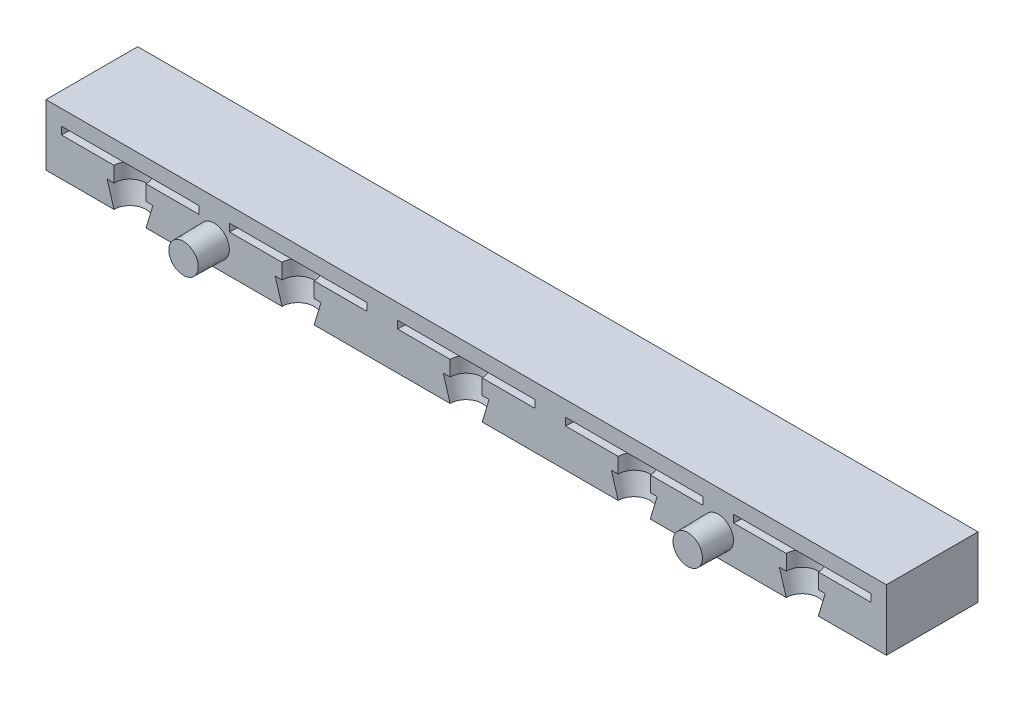
ISO-10303-21;
HEADER;
FILE_DESCRIPTION(('STEP AP214'),'2;1');
FILE_NAME('part.step','',(''),(''),'','','');
FILE_SCHEMA(('AUTOMOTIVE_DESIGN { 1 0 10303 214 1 1 1 1 }'));
ENDSEC;
DATA;
#1=APPLICATION_CONTEXT('core data for automotive mechanical design processes');
#2=APPLICATION_PROTOCOL_DEFINITION('international standard','automotive_design',2000,#1);
#3=PRODUCT_CONTEXT('',#1,'mechanical');
#4=PRODUCT('Part','Part','',(#3));
#5=PRODUCT_RELATED_PRODUCT_CATEGORY('part','',(#4));
#6=PRODUCT_DEFINITION_FORMATION('','',#4);
#7=PRODUCT_DEFINITION_CONTEXT('part definition',#1,'design');
#8=PRODUCT_DEFINITION('design','',#6,#7);
#9=PRODUCT_DEFINITION_SHAPE('','',#8);
#10=(LENGTH_UNIT() NAMED_UNIT(*) SI_UNIT(.MILLI.,.METRE.));
#11=(NAMED_UNIT(*) PLANE_ANGLE_UNIT() SI_UNIT($,.RADIAN.));
#12=(NAMED_UNIT(*) SI_UNIT($,.STERADIAN.) SOLID_ANGLE_UNIT());
#13=UNCERTAINTY_MEASURE_WITH_UNIT(LENGTH_MEASURE(1.E-05),#10,'distance_accuracy_value','');
#14=(GEOMETRIC_REPRESENTATION_CONTEXT(3) GLOBAL_UNCERTAINTY_ASSIGNED_CONTEXT((#13)) GLOBAL_UNIT_ASSIGNED_CONTEXT((#10,
#11,#12)) REPRESENTATION_CONTEXT('',''));
#15=CARTESIAN_POINT('',(0.,0.,0.));
#16=DIRECTION('',(0.,0.,1.));
#17=DIRECTION('',(1.,0.,0.));
#18=AXIS2_PLACEMENT_3D('',#15,#16,#17);
#19=CARTESIAN_POINT('',(0.,0.,-12.));
#20=DIRECTION('',(-1.,0.,0.));
#21=DIRECTION('',(0.,0.,1.));
#22=AXIS2_PLACEMENT_3D('',#19,#20,#21);
#23=PLANE('',#22);
#24=DIRECTION('',(0.,-1.,0.));
#25=VECTOR('',#24,1.);
#26=CARTESIAN_POINT('',(0.,0.,0.));
#27=LINE('',#26,#25);
#28=CARTESIAN_POINT('',(0.,8.,0.));
#29=VERTEX_POINT('',#28);
#30=CARTESIAN_POINT('',(0.,0.,0.));
#31=VERTEX_POINT('',#30);
#32=EDGE_CURVE('E323',#29,#31,#27,.T.);
#33=ORIENTED_EDGE('',*,*,#32,.F.);
#34=DIRECTION('',(0.,0.,1.));
#35=VECTOR('',#34,1.);
#36=CARTESIAN_POINT('',(0.,8.,-12.));
#37=LINE('',#36,#35);
#38=CARTESIAN_POINT('',(0.,8.,-12.));
#39=VERTEX_POINT('',#38);
#40=EDGE_CURVE('E326',#39,#29,#37,.T.);
#41=ORIENTED_EDGE('',*,*,#40,.F.);
#42=DIRECTION('',(0.,-1.,0.));
#43=VECTOR('',#42,1.);
#44=CARTESIAN_POINT('',(0.,0.,-12.));
#45=LINE('',#44,#43);
#46=CARTESIAN_POINT('',(0.,0.,-12.));
#47=VERTEX_POINT('',#46);
#48=EDGE_CURVE('E339',#39,#47,#45,.T.);
#49=ORIENTED_EDGE('',*,*,#48,.T.);
#50=DIRECTION('',(0.,0.,1.));
#51=VECTOR('',#50,1.);
#52=CARTESIAN_POINT('',(0.,0.,-12.));
#53=LINE('',#52,#51);
#54=EDGE_CURVE('E328',#47,#31,#53,.T.);
#55=ORIENTED_EDGE('',*,*,#54,.T.);
#56=EDGE_LOOP('',(#33,#41,#49,#55));
#57=FACE_BOUND('',#56,.T.);
#58=ADVANCED_FACE('F33',(#57),#23,.T.);
#59=CARTESIAN_POINT('',(0.,8.,-12.));
#60=DIRECTION('',(0.,1.,0.));
#61=DIRECTION('',(0.,0.,1.));
#62=AXIS2_PLACEMENT_3D('',#59,#60,#61);
#63=PLANE('',#62);
#64=DIRECTION('',(-1.,0.,0.));
#65=VECTOR('',#64,1.);
#66=CARTESIAN_POINT('',(0.,8.,0.));
#67=LINE('',#66,#65);
#68=CARTESIAN_POINT('',(110.,8.,0.));
#69=VERTEX_POINT('',#68);
#70=EDGE_CURVE('E336',#69,#29,#67,.T.);
#71=ORIENTED_EDGE('',*,*,#70,.F.);
#72=DIRECTION('',(0.,0.,1.));
#73=VECTOR('',#72,1.);
#74=CARTESIAN_POINT('',(110.,8.,-12.));
#75=LINE('',#74,#73);
#76=CARTESIAN_POINT('',(110.,8.,-12.));
#77=VERTEX_POINT('',#76);
#78=EDGE_CURVE('E349',#77,#69,#75,.T.);
#79=ORIENTED_EDGE('',*,*,#78,.F.);
#80=DIRECTION('',(-1.,0.,0.));
#81=VECTOR('',#80,1.);
#82=CARTESIAN_POINT('',(0.,8.,-12.));
#83=LINE('',#82,#81);
#84=EDGE_CURVE('E355',#77,#39,#83,.T.);
#85=ORIENTED_EDGE('',*,*,#84,.T.);
#86=ORIENTED_EDGE('',*,*,#40,.T.);
#87=EDGE_LOOP('',(#71,#79,#85,#86));
#88=FACE_BOUND('',#87,.T.);
#89=ADVANCED_FACE('F314',(#88),#63,.T.);
#90=CARTESIAN_POINT('',(110.,0.,-12.));
#91=DIRECTION('',(1.,0.,0.));
#92=DIRECTION('',(0.,0.,-1.));
#93=AXIS2_PLACEMENT_3D('',#90,#91,#92);
#94=PLANE('',#93);
#95=DIRECTION('',(0.,1.,0.));
#96=VECTOR('',#95,1.);
#97=CARTESIAN_POINT('',(110.,0.,0.));
#98=LINE('',#97,#96);
#99=CARTESIAN_POINT('',(110.,0.,0.));
#100=VERTEX_POINT('',#99);
#101=EDGE_CURVE('E338',#100,#69,#98,.T.);
#102=ORIENTED_EDGE('',*,*,#101,.F.);
#103=DIRECTION('',(0.,0.,1.));
#104=VECTOR('',#103,1.);
#105=CARTESIAN_POINT('',(110.,0.,-12.));
#106=LINE('',#105,#104);
#107=CARTESIAN_POINT('',(110.,0.,-12.));
#108=VERTEX_POINT('',#107);
#109=EDGE_CURVE('E351',#108,#100,#106,.T.);
#110=ORIENTED_EDGE('',*,*,#109,.F.);
#111=DIRECTION('',(0.,1.,0.));
#112=VECTOR('',#111,1.);
#113=CARTESIAN_POINT('',(110.,0.,-12.));
#114=LINE('',#113,#112);
#115=EDGE_CURVE('E544',#108,#77,#114,.T.);
#116=ORIENTED_EDGE('',*,*,#115,.T.);
#117=ORIENTED_EDGE('',*,*,#78,.T.);
#118=EDGE_LOOP('',(#102,#110,#116,#117));
#119=FACE_BOUND('',#118,.T.);
#120=ADVANCED_FACE('F319',(#119),#94,.T.);
#121=CARTESIAN_POINT('',(0.,0.,-12.));
#122=DIRECTION('',(0.,-1.,0.));
#123=DIRECTION('',(0.,0.,-1.));
#124=AXIS2_PLACEMENT_3D('',#121,#122,#123);
#125=PLANE('',#124);
#126=CARTESIAN_POINT('',(99.,0.,0.));
#127=DIRECTION('',(0.,1.,0.));
#128=DIRECTION('',(-1.,0.,0.));
#129=AXIS2_PLACEMENT_3D('',#126,#127,#128);
#130=CIRCLE('',#129,2.1);
#131=CARTESIAN_POINT('',(101.1,0.,0.));
#132=VERTEX_POINT('',#131);
#133=CARTESIAN_POINT('',(96.9,0.,0.));
#134=VERTEX_POINT('',#133);
#135=EDGE_CURVE('E654',#132,#134,#130,.T.);
#136=ORIENTED_EDGE('',*,*,#135,.T.);
#137=DIRECTION('',(1.,0.,0.));
#138=VECTOR('',#137,1.);
#139=CARTESIAN_POINT('',(0.,0.,0.));
#140=LINE('',#139,#138);
#141=CARTESIAN_POINT('',(79.1,0.,0.));
#142=VERTEX_POINT('',#141);
#143=EDGE_CURVE('E484',#142,#134,#140,.T.);
#144=ORIENTED_EDGE('',*,*,#143,.F.);
#145=CARTESIAN_POINT('',(77.,0.,0.));
#146=DIRECTION('',(0.,1.,0.));
#147=DIRECTION('',(-1.,0.,0.));
#148=AXIS2_PLACEMENT_3D('',#145,#146,#147);
#149=CIRCLE('',#148,2.1);
#150=CARTESIAN_POINT('',(74.9,0.,0.));
#151=VERTEX_POINT('',#150);
#152=EDGE_CURVE('E477',#142,#151,#149,.T.);
#153=ORIENTED_EDGE('',*,*,#152,.T.);
#154=CARTESIAN_POINT('',(57.1,0.,0.));
#155=VERTEX_POINT('',#154);
#156=EDGE_CURVE('E472',#155,#151,#140,.T.);
#157=ORIENTED_EDGE('',*,*,#156,.F.);
#158=CARTESIAN_POINT('',(55.,0.,0.));
#159=DIRECTION('',(0.,1.,0.));
#160=DIRECTION('',(-1.,0.,0.));
#161=AXIS2_PLACEMENT_3D('',#158,#159,#160);
#162=CIRCLE('',#161,2.1);
#163=CARTESIAN_POINT('',(52.9,0.,0.));
#164=VERTEX_POINT('',#163);
#165=EDGE_CURVE('E505',#155,#164,#162,.T.);
#166=ORIENTED_EDGE('',*,*,#165,.T.);
#167=CARTESIAN_POINT('',(35.1,0.,0.));
#168=VERTEX_POINT('',#167);
#169=EDGE_CURVE('E550',#168,#164,#140,.T.);
#170=ORIENTED_EDGE('',*,*,#169,.F.);
#171=CARTESIAN_POINT('',(33.,0.,0.));
#172=DIRECTION('',(0.,1.,0.));
#173=DIRECTION('',(-1.,0.,0.));
#174=AXIS2_PLACEMENT_3D('',#171,#172,#173);
#175=CIRCLE('',#174,2.1);
#176=CARTESIAN_POINT('',(30.9,0.,0.));
#177=VERTEX_POINT('',#176);
#178=EDGE_CURVE('E522',#168,#177,#175,.T.);
#179=ORIENTED_EDGE('',*,*,#178,.T.);
#180=CARTESIAN_POINT('',(13.1,0.,0.));
#181=VERTEX_POINT('',#180);
#182=EDGE_CURVE('E548',#181,#177,#140,.T.);
#183=ORIENTED_EDGE('',*,*,#182,.F.);
#184=CARTESIAN_POINT('',(11.,0.,0.));
#185=DIRECTION('',(0.,1.,0.));
#186=DIRECTION('',(-1.,0.,0.));
#187=AXIS2_PLACEMENT_3D('',#184,#185,#186);
#188=CIRCLE('',#187,2.1);
#189=CARTESIAN_POINT('',(8.9,0.,0.));
#190=VERTEX_POINT('',#189);
#191=EDGE_CURVE('E332',#181,#190,#188,.T.);
#192=ORIENTED_EDGE('',*,*,#191,.T.);
#193=EDGE_CURVE('E343',#31,#190,#140,.T.);
#194=ORIENTED_EDGE('',*,*,#193,.F.);
#195=ORIENTED_EDGE('',*,*,#54,.F.);
#196=DIRECTION('',(1.,0.,0.));
#197=VECTOR('',#196,1.);
#198=CARTESIAN_POINT('',(0.,0.,-12.));
#199=LINE('',#198,#197);
#200=EDGE_CURVE('E341',#47,#108,#199,.T.);
#201=ORIENTED_EDGE('',*,*,#200,.T.);
#202=ORIENTED_EDGE('',*,*,#109,.T.);
#203=EDGE_CURVE('E331',#132,#100,#140,.T.);
#204=ORIENTED_EDGE('',*,*,#203,.F.);
#205=EDGE_LOOP('',(#136,#144,#153,#157,#166,#170,#179,#183,#192,#194,#195,#201,#202,#204));
#206=FACE_BOUND('',#205,.T.);
#207=ADVANCED_FACE('F308',(#206),#125,.T.);
#208=CARTESIAN_POINT('',(0.,0.,-12.));
#209=DIRECTION('',(0.,0.,-1.));
#210=DIRECTION('',(-1.,0.,0.));
#211=AXIS2_PLACEMENT_3D('',#208,#209,#210);
#212=PLANE('',#211);
#213=ORIENTED_EDGE('',*,*,#48,.F.);
#214=ORIENTED_EDGE('',*,*,#84,.F.);
#215=ORIENTED_EDGE('',*,*,#115,.F.);
#216=ORIENTED_EDGE('',*,*,#200,.F.);
#217=EDGE_LOOP('',(#213,#214,#215,#216));
#218=FACE_BOUND('',#217,.T.);
#219=ADVANCED_FACE('F298',(#218),#212,.T.);
#220=CARTESIAN_POINT('',(0.,0.,0.));
#221=DIRECTION('',(0.,0.,-1.));
#222=DIRECTION('',(-1.,0.,0.));
#223=AXIS2_PLACEMENT_3D('',#220,#221,#222);
#224=PLANE('',#223);
#225=CARTESIAN_POINT('',(88.,3.,0.));
#226=DIRECTION('',(0.,0.,-1.));
#227=DIRECTION('',(-1.,0.,0.));
#228=AXIS2_PLACEMENT_3D('',#225,#226,#227);
#229=CIRCLE('',#228,2.);
#230=CARTESIAN_POINT('',(86.,3.,0.));
#231=VERTEX_POINT('',#230);
#232=EDGE_CURVE('E11',#231,#231,#229,.F.);
#233=ORIENTED_EDGE('',*,*,#232,.F.);
#234=EDGE_LOOP('',(#233));
#235=FACE_BOUND('',#234,.T.);
#236=CARTESIAN_POINT('',(22.,3.,0.));
#237=DIRECTION('',(0.,0.,-1.));
#238=DIRECTION('',(-1.,0.,0.));
#239=AXIS2_PLACEMENT_3D('',#236,#237,#238);
#240=CIRCLE('',#239,2.);
#241=CARTESIAN_POINT('',(20.,3.,0.));
#242=VERTEX_POINT('',#241);
#243=EDGE_CURVE('E40',#242,#242,#240,.F.);
#244=ORIENTED_EDGE('',*,*,#243,.F.);
#245=EDGE_LOOP('',(#244));
#246=FACE_BOUND('',#245,.T.);
#247=ORIENTED_EDGE('',*,*,#143,.T.);
#248=DIRECTION('',(-0.287347885566346,0.957826285221151,0.));
#249=VECTOR('',#248,1.);
#250=CARTESIAN_POINT('',(99.,-7.,0.));
#251=LINE('',#250,#249);
#252=CARTESIAN_POINT('',(96.,3.,0.));
#253=VERTEX_POINT('',#252);
#254=EDGE_CURVE('E289',#134,#253,#251,.T.);
#255=ORIENTED_EDGE('',*,*,#254,.T.);
#256=DIRECTION('',(1.,0.,0.));
#257=VECTOR('',#256,1.);
#258=CARTESIAN_POINT('',(0.,2.99999999999998,0.));
#259=LINE('',#258,#257);
#260=CARTESIAN_POINT('',(96.9,3.,0.));
#261=VERTEX_POINT('',#260);
#262=EDGE_CURVE('E285',#253,#261,#259,.T.);
#263=ORIENTED_EDGE('',*,*,#262,.T.);
#264=DIRECTION('',(0.,1.,0.));
#265=VECTOR('',#264,1.);
#266=CARTESIAN_POINT('',(96.9,6.,0.));
#267=LINE('',#266,#265);
#268=CARTESIAN_POINT('',(96.9,5.,0.));
#269=VERTEX_POINT('',#268);
#270=EDGE_CURVE('E280',#261,#269,#267,.T.);
#271=ORIENTED_EDGE('',*,*,#270,.T.);
#272=DIRECTION('',(-1.,0.,0.));
#273=VECTOR('',#272,1.);
#274=CARTESIAN_POINT('',(0.,4.99999999999998,0.));
#275=LINE('',#274,#273);
#276=CARTESIAN_POINT('',(90.,5.,0.));
#277=VERTEX_POINT('',#276);
#278=EDGE_CURVE('E271',#269,#277,#275,.T.);
#279=ORIENTED_EDGE('',*,*,#278,.T.);
#280=DIRECTION('',(0.,1.,0.));
#281=VECTOR('',#280,1.);
#282=CARTESIAN_POINT('',(90.,6.,0.));
#283=LINE('',#282,#281);
#284=CARTESIAN_POINT('',(90.,6.,0.));
#285=VERTEX_POINT('',#284);
#286=EDGE_CURVE('E262',#277,#285,#283,.T.);
#287=ORIENTED_EDGE('',*,*,#286,.T.);
#288=DIRECTION('',(1.,0.,0.));
#289=VECTOR('',#288,1.);
#290=CARTESIAN_POINT('',(0.,5.99999999999997,0.));
#291=LINE('',#290,#289);
#292=CARTESIAN_POINT('',(108.,6.,0.));
#293=VERTEX_POINT('',#292);
#294=EDGE_CURVE('E251',#285,#293,#291,.T.);
#295=ORIENTED_EDGE('',*,*,#294,.T.);
#296=DIRECTION('',(0.,1.,0.));
#297=VECTOR('',#296,1.);
#298=CARTESIAN_POINT('',(108.,6.,0.));
#299=LINE('',#298,#297);
#300=CARTESIAN_POINT('',(108.,5.00000000000001,0.));
#301=VERTEX_POINT('',#300);
#302=EDGE_CURVE('E256',#293,#301,#299,.F.);
#303=ORIENTED_EDGE('',*,*,#302,.T.);
#304=CARTESIAN_POINT('',(101.1,5.,0.));
#305=VERTEX_POINT('',#304);
#306=EDGE_CURVE('E273',#301,#305,#275,.T.);
#307=ORIENTED_EDGE('',*,*,#306,.T.);
#308=DIRECTION('',(0.,1.,0.));
#309=VECTOR('',#308,1.);
#310=CARTESIAN_POINT('',(101.1,6.,0.));
#311=LINE('',#310,#309);
#312=CARTESIAN_POINT('',(101.1,3.,0.));
#313=VERTEX_POINT('',#312);
#314=EDGE_CURVE('E277',#305,#313,#311,.F.);
#315=ORIENTED_EDGE('',*,*,#314,.T.);
#316=CARTESIAN_POINT('',(102.,3.,0.));
#317=VERTEX_POINT('',#316);
#318=EDGE_CURVE('E282',#313,#317,#259,.T.);
#319=ORIENTED_EDGE('',*,*,#318,.T.);
#320=DIRECTION('',(-0.287347885566345,-0.957826285221152,0.));
#321=VECTOR('',#320,1.);
#322=CARTESIAN_POINT('',(99.,-7.,0.));
#323=LINE('',#322,#321);
#324=EDGE_CURVE('E286',#317,#132,#323,.T.);
#325=ORIENTED_EDGE('',*,*,#324,.T.);
#326=ORIENTED_EDGE('',*,*,#203,.T.);
#327=ORIENTED_EDGE('',*,*,#101,.T.);
#328=ORIENTED_EDGE('',*,*,#70,.T.);
#329=ORIENTED_EDGE('',*,*,#32,.T.);
#330=ORIENTED_EDGE('',*,*,#193,.T.);
#331=DIRECTION('',(-0.287347885566346,0.957826285221151,0.));
#332=VECTOR('',#331,1.);
#333=CARTESIAN_POINT('',(11.,-7.,0.));
#334=LINE('',#333,#332);
#335=CARTESIAN_POINT('',(8.,3.,0.));
#336=VERTEX_POINT('',#335);
#337=EDGE_CURVE('E381',#190,#336,#334,.T.);
#338=ORIENTED_EDGE('',*,*,#337,.T.);
#339=DIRECTION('',(1.,0.,0.));
#340=VECTOR('',#339,1.);
#341=CARTESIAN_POINT('',(0.,3.,0.));
#342=LINE('',#341,#340);
#343=CARTESIAN_POINT('',(8.9,3.,0.));
#344=VERTEX_POINT('',#343);
#345=EDGE_CURVE('E377',#336,#344,#342,.T.);
#346=ORIENTED_EDGE('',*,*,#345,.T.);
#347=DIRECTION('',(0.,1.,0.));
#348=VECTOR('',#347,1.);
#349=CARTESIAN_POINT('',(8.9,6.,0.));
#350=LINE('',#349,#348);
#351=CARTESIAN_POINT('',(8.9,5.,0.));
#352=VERTEX_POINT('',#351);
#353=EDGE_CURVE('E371',#344,#352,#350,.T.);
#354=ORIENTED_EDGE('',*,*,#353,.T.);
#355=DIRECTION('',(-1.,0.,0.));
#356=VECTOR('',#355,1.);
#357=CARTESIAN_POINT('',(0.,5.,0.));
#358=LINE('',#357,#356);
#359=CARTESIAN_POINT('',(1.99999999999999,5.,0.));
#360=VERTEX_POINT('',#359);
#361=EDGE_CURVE('E364',#352,#360,#358,.T.);
#362=ORIENTED_EDGE('',*,*,#361,.T.);
#363=DIRECTION('',(0.,1.,0.));
#364=VECTOR('',#363,1.);
#365=CARTESIAN_POINT('',(1.99999999999999,6.,0.));
#366=LINE('',#365,#364);
#367=CARTESIAN_POINT('',(1.99999999999999,6.,0.));
#368=VERTEX_POINT('',#367);
#369=EDGE_CURVE('E361',#360,#368,#366,.T.);
#370=ORIENTED_EDGE('',*,*,#369,.T.);
#371=DIRECTION('',(1.,0.,0.));
#372=VECTOR('',#371,1.);
#373=CARTESIAN_POINT('',(0.,6.,0.));
#374=LINE('',#373,#372);
#375=CARTESIAN_POINT('',(20.,6.,0.));
#376=VERTEX_POINT('',#375);
#377=EDGE_CURVE('E348',#368,#376,#374,.T.);
#378=ORIENTED_EDGE('',*,*,#377,.T.);
#379=DIRECTION('',(0.,1.,0.));
#380=VECTOR('',#379,1.);
#381=CARTESIAN_POINT('',(20.,6.,0.));
#382=LINE('',#381,#380);
#383=CARTESIAN_POINT('',(20.,5.,0.));
#384=VERTEX_POINT('',#383);
#385=EDGE_CURVE('E358',#376,#384,#382,.F.);
#386=ORIENTED_EDGE('',*,*,#385,.T.);
#387=CARTESIAN_POINT('',(13.1,5.,0.));
#388=VERTEX_POINT('',#387);
#389=EDGE_CURVE('E367',#384,#388,#358,.T.);
#390=ORIENTED_EDGE('',*,*,#389,.T.);
#391=DIRECTION('',(0.,1.,0.));
#392=VECTOR('',#391,1.);
#393=CARTESIAN_POINT('',(13.1,6.,0.));
#394=LINE('',#393,#392);
#395=CARTESIAN_POINT('',(13.1,3.,0.));
#396=VERTEX_POINT('',#395);
#397=EDGE_CURVE('E368',#388,#396,#394,.F.);
#398=ORIENTED_EDGE('',*,*,#397,.T.);
#399=CARTESIAN_POINT('',(14.,3.,0.));
#400=VERTEX_POINT('',#399);
#401=EDGE_CURVE('E374',#396,#400,#342,.T.);
#402=ORIENTED_EDGE('',*,*,#401,.T.);
#403=DIRECTION('',(-0.287347885566345,-0.957826285221152,0.));
#404=VECTOR('',#403,1.);
#405=CARTESIAN_POINT('',(11.,-7.,0.));
#406=LINE('',#405,#404);
#407=EDGE_CURVE('E378',#400,#181,#406,.T.);
#408=ORIENTED_EDGE('',*,*,#407,.T.);
#409=ORIENTED_EDGE('',*,*,#182,.T.);
#410=DIRECTION('',(-0.287347885566346,0.957826285221151,0.));
#411=VECTOR('',#410,1.);
#412=CARTESIAN_POINT('',(33.,-7.,0.));
#413=LINE('',#412,#411);
#414=CARTESIAN_POINT('',(30.,3.,0.));
#415=VERTEX_POINT('',#414);
#416=EDGE_CURVE('E410',#177,#415,#413,.T.);
#417=ORIENTED_EDGE('',*,*,#416,.T.);
#418=DIRECTION('',(1.,0.,0.));
#419=VECTOR('',#418,1.);
#420=CARTESIAN_POINT('',(0.,2.99999999999999,0.));
#421=LINE('',#420,#419);
#422=CARTESIAN_POINT('',(30.9,3.,0.));
#423=VERTEX_POINT('',#422);
#424=EDGE_CURVE('E406',#415,#423,#421,.T.);
#425=ORIENTED_EDGE('',*,*,#424,.T.);
#426=DIRECTION('',(0.,1.,0.));
#427=VECTOR('',#426,1.);
#428=CARTESIAN_POINT('',(30.9,6.,0.));
#429=LINE('',#428,#427);
#430=CARTESIAN_POINT('',(30.9,5.,0.));
#431=VERTEX_POINT('',#430);
#432=EDGE_CURVE('E400',#423,#431,#429,.T.);
#433=ORIENTED_EDGE('',*,*,#432,.T.);
#434=DIRECTION('',(-1.,0.,0.));
#435=VECTOR('',#434,1.);
#436=CARTESIAN_POINT('',(0.,4.99999999999999,0.));
#437=LINE('',#436,#435);
#438=CARTESIAN_POINT('',(24.,5.,0.));
#439=VERTEX_POINT('',#438);
#440=EDGE_CURVE('E393',#431,#439,#437,.T.);
#441=ORIENTED_EDGE('',*,*,#440,.T.);
#442=DIRECTION('',(0.,1.,0.));
#443=VECTOR('',#442,1.);
#444=CARTESIAN_POINT('',(24.,6.,0.));
#445=LINE('',#444,#443);
#446=CARTESIAN_POINT('',(24.,6.,0.));
#447=VERTEX_POINT('',#446);
#448=EDGE_CURVE('E390',#439,#447,#445,.T.);
#449=ORIENTED_EDGE('',*,*,#448,.T.);
#450=DIRECTION('',(1.,0.,0.));
#451=VECTOR('',#450,1.);
#452=CARTESIAN_POINT('',(0.,5.99999999999999,0.));
#453=LINE('',#452,#451);
#454=CARTESIAN_POINT('',(42.,6.,0.));
#455=VERTEX_POINT('',#454);
#456=EDGE_CURVE('E384',#447,#455,#453,.T.);
#457=ORIENTED_EDGE('',*,*,#456,.T.);
#458=DIRECTION('',(0.,1.,0.));
#459=VECTOR('',#458,1.);
#460=CARTESIAN_POINT('',(42.,6.,0.));
#461=LINE('',#460,#459);
#462=CARTESIAN_POINT('',(42.,5.,0.));
#463=VERTEX_POINT('',#462);
#464=EDGE_CURVE('E387',#455,#463,#461,.F.);
#465=ORIENTED_EDGE('',*,*,#464,.T.);
#466=CARTESIAN_POINT('',(35.1,5.,0.));
#467=VERTEX_POINT('',#466);
#468=EDGE_CURVE('E396',#463,#467,#437,.T.);
#469=ORIENTED_EDGE('',*,*,#468,.T.);
#470=DIRECTION('',(0.,1.,0.));
#471=VECTOR('',#470,1.);
#472=CARTESIAN_POINT('',(35.1,6.,0.));
#473=LINE('',#472,#471);
#474=CARTESIAN_POINT('',(35.1,3.,0.));
#475=VERTEX_POINT('',#474);
#476=EDGE_CURVE('E397',#467,#475,#473,.F.);
#477=ORIENTED_EDGE('',*,*,#476,.T.);
#478=CARTESIAN_POINT('',(36.,3.,0.));
#479=VERTEX_POINT('',#478);
#480=EDGE_CURVE('E403',#475,#479,#421,.T.);
#481=ORIENTED_EDGE('',*,*,#480,.T.);
#482=DIRECTION('',(-0.287347885566345,-0.957826285221152,0.));
#483=VECTOR('',#482,1.);
#484=CARTESIAN_POINT('',(33.,-7.,0.));
#485=LINE('',#484,#483);
#486=EDGE_CURVE('E407',#479,#168,#485,.T.);
#487=ORIENTED_EDGE('',*,*,#486,.T.);
#488=ORIENTED_EDGE('',*,*,#169,.T.);
#489=DIRECTION('',(-0.287347885566346,0.957826285221151,0.));
#490=VECTOR('',#489,1.);
#491=CARTESIAN_POINT('',(55.,-7.,0.));
#492=LINE('',#491,#490);
#493=CARTESIAN_POINT('',(52.,3.,0.));
#494=VERTEX_POINT('',#493);
#495=EDGE_CURVE('E439',#164,#494,#492,.T.);
#496=ORIENTED_EDGE('',*,*,#495,.T.);
#497=DIRECTION('',(1.,0.,0.));
#498=VECTOR('',#497,1.);
#499=CARTESIAN_POINT('',(0.,2.99999999999999,0.));
#500=LINE('',#499,#498);
#501=CARTESIAN_POINT('',(52.9,3.,0.));
#502=VERTEX_POINT('',#501);
#503=EDGE_CURVE('E435',#494,#502,#500,.T.);
#504=ORIENTED_EDGE('',*,*,#503,.T.);
#505=DIRECTION('',(0.,1.,0.));
#506=VECTOR('',#505,1.);
#507=CARTESIAN_POINT('',(52.9,6.,0.));
#508=LINE('',#507,#506);
#509=CARTESIAN_POINT('',(52.9,5.,0.));
#510=VERTEX_POINT('',#509);
#511=EDGE_CURVE('E429',#502,#510,#508,.T.);
#512=ORIENTED_EDGE('',*,*,#511,.T.);
#513=DIRECTION('',(-1.,0.,0.));
#514=VECTOR('',#513,1.);
#515=CARTESIAN_POINT('',(0.,4.99999999999999,0.));
#516=LINE('',#515,#514);
#517=CARTESIAN_POINT('',(46.,5.,0.));
#518=VERTEX_POINT('',#517);
#519=EDGE_CURVE('E422',#510,#518,#516,.T.);
#520=ORIENTED_EDGE('',*,*,#519,.T.);
#521=DIRECTION('',(0.,1.,0.));
#522=VECTOR('',#521,1.);
#523=CARTESIAN_POINT('',(46.,6.,0.));
#524=LINE('',#523,#522);
#525=CARTESIAN_POINT('',(46.,6.,0.));
#526=VERTEX_POINT('',#525);
#527=EDGE_CURVE('E419',#518,#526,#524,.T.);
#528=ORIENTED_EDGE('',*,*,#527,.T.);
#529=DIRECTION('',(1.,0.,0.));
#530=VECTOR('',#529,1.);
#531=CARTESIAN_POINT('',(0.,5.99999999999998,0.));
#532=LINE('',#531,#530);
#533=CARTESIAN_POINT('',(64.,6.,0.));
#534=VERTEX_POINT('',#533);
#535=EDGE_CURVE('E413',#526,#534,#532,.T.);
#536=ORIENTED_EDGE('',*,*,#535,.T.);
#537=DIRECTION('',(0.,1.,0.));
#538=VECTOR('',#537,1.);
#539=CARTESIAN_POINT('',(64.,6.,0.));
#540=LINE('',#539,#538);
#541=CARTESIAN_POINT('',(64.,5.,0.));
#542=VERTEX_POINT('',#541);
#543=EDGE_CURVE('E416',#534,#542,#540,.F.);
#544=ORIENTED_EDGE('',*,*,#543,.T.);
#545=CARTESIAN_POINT('',(57.1,5.,0.));
#546=VERTEX_POINT('',#545);
#547=EDGE_CURVE('E425',#542,#546,#516,.T.);
#548=ORIENTED_EDGE('',*,*,#547,.T.);
#549=DIRECTION('',(0.,1.,0.));
#550=VECTOR('',#549,1.);
#551=CARTESIAN_POINT('',(57.1,6.,0.));
#552=LINE('',#551,#550);
#553=CARTESIAN_POINT('',(57.1,3.,0.));
#554=VERTEX_POINT('',#553);
#555=EDGE_CURVE('E426',#546,#554,#552,.F.);
#556=ORIENTED_EDGE('',*,*,#555,.T.);
#557=CARTESIAN_POINT('',(58.,3.,0.));
#558=VERTEX_POINT('',#557);
#559=EDGE_CURVE('E432',#554,#558,#500,.T.);
#560=ORIENTED_EDGE('',*,*,#559,.T.);
#561=DIRECTION('',(-0.287347885566345,-0.957826285221152,0.));
#562=VECTOR('',#561,1.);
#563=CARTESIAN_POINT('',(55.,-7.,0.));
#564=LINE('',#563,#562);
#565=EDGE_CURVE('E436',#558,#155,#564,.T.);
#566=ORIENTED_EDGE('',*,*,#565,.T.);
#567=ORIENTED_EDGE('',*,*,#156,.T.);
#568=DIRECTION('',(-0.287347885566346,0.957826285221151,0.));
#569=VECTOR('',#568,1.);
#570=CARTESIAN_POINT('',(77.,-7.,0.));
#571=LINE('',#570,#569);
#572=CARTESIAN_POINT('',(74.,3.,0.));
#573=VERTEX_POINT('',#572);
#574=EDGE_CURVE('E257',#151,#573,#571,.T.);
#575=ORIENTED_EDGE('',*,*,#574,.T.);
#576=DIRECTION('',(1.,0.,0.));
#577=VECTOR('',#576,1.);
#578=CARTESIAN_POINT('',(0.,2.99999999999998,0.));
#579=LINE('',#578,#577);
#580=CARTESIAN_POINT('',(74.9,3.,0.));
#581=VERTEX_POINT('',#580);
#582=EDGE_CURVE('E464',#573,#581,#579,.T.);
#583=ORIENTED_EDGE('',*,*,#582,.T.);
#584=DIRECTION('',(0.,1.,0.));
#585=VECTOR('',#584,1.);
#586=CARTESIAN_POINT('',(74.9,6.,0.));
#587=LINE('',#586,#585);
#588=CARTESIAN_POINT('',(74.9,5.,0.));
#589=VERTEX_POINT('',#588);
#590=EDGE_CURVE('E458',#581,#589,#587,.T.);
#591=ORIENTED_EDGE('',*,*,#590,.T.);
#592=DIRECTION('',(-1.,0.,0.));
#593=VECTOR('',#592,1.);
#594=CARTESIAN_POINT('',(0.,4.99999999999998,0.));
#595=LINE('',#594,#593);
#596=CARTESIAN_POINT('',(68.,5.,0.));
#597=VERTEX_POINT('',#596);
#598=EDGE_CURVE('E451',#589,#597,#595,.T.);
#599=ORIENTED_EDGE('',*,*,#598,.T.);
#600=DIRECTION('',(0.,1.,0.));
#601=VECTOR('',#600,1.);
#602=CARTESIAN_POINT('',(68.,6.,0.));
#603=LINE('',#602,#601);
#604=CARTESIAN_POINT('',(68.,6.,0.));
#605=VERTEX_POINT('',#604);
#606=EDGE_CURVE('E448',#597,#605,#603,.T.);
#607=ORIENTED_EDGE('',*,*,#606,.T.);
#608=DIRECTION('',(1.,0.,0.));
#609=VECTOR('',#608,1.);
#610=CARTESIAN_POINT('',(0.,5.99999999999998,0.));
#611=LINE('',#610,#609);
#612=CARTESIAN_POINT('',(86.,6.,0.));
#613=VERTEX_POINT('',#612);
#614=EDGE_CURVE('E442',#605,#613,#611,.T.);
#615=ORIENTED_EDGE('',*,*,#614,.T.);
#616=DIRECTION('',(0.,1.,0.));
#617=VECTOR('',#616,1.);
#618=CARTESIAN_POINT('',(86.,6.,0.));
#619=LINE('',#618,#617);
#620=CARTESIAN_POINT('',(86.,5.,0.));
#621=VERTEX_POINT('',#620);
#622=EDGE_CURVE('E445',#613,#621,#619,.F.);
#623=ORIENTED_EDGE('',*,*,#622,.T.);
#624=CARTESIAN_POINT('',(79.1,5.,0.));
#625=VERTEX_POINT('',#624);
#626=EDGE_CURVE('E454',#621,#625,#595,.T.);
#627=ORIENTED_EDGE('',*,*,#626,.T.);
#628=DIRECTION('',(0.,1.,0.));
#629=VECTOR('',#628,1.);
#630=CARTESIAN_POINT('',(79.1,6.,0.));
#631=LINE('',#630,#629);
#632=CARTESIAN_POINT('',(79.1,3.,0.));
#633=VERTEX_POINT('',#632);
#634=EDGE_CURVE('E455',#625,#633,#631,.F.);
#635=ORIENTED_EDGE('',*,*,#634,.T.);
#636=CARTESIAN_POINT('',(80.,3.,0.));
#637=VERTEX_POINT('',#636);
#638=EDGE_CURVE('E461',#633,#637,#579,.T.);
#639=ORIENTED_EDGE('',*,*,#638,.T.);
#640=DIRECTION('',(-0.287347885566345,-0.957826285221152,0.));
#641=VECTOR('',#640,1.);
#642=CARTESIAN_POINT('',(77.,-7.,0.));
#643=LINE('',#642,#641);
#644=EDGE_CURVE('E465',#637,#142,#643,.T.);
#645=ORIENTED_EDGE('',*,*,#644,.T.);
#646=EDGE_LOOP('',(#247,#255,#263,#271,#279,#287,#295,#303,#307,#315,#319,#325,#326,#327,#328,
#329,#330,#338,#346,#354,#362,#370,#378,#386,#390,#398,#402,#408,#409,#417,#425,#433,#441,#449,
#457,#465,#469,#477,#481,#487,#488,#496,#504,#512,#520,#528,#536,#544,#548,#556,#560,#566,#567,
#575,#583,#591,#599,#607,#615,#623,#627,#635,#639,#645));
#647=FACE_BOUND('',#646,.T.);
#648=ADVANCED_FACE('F269',(#235,#246,#647),#224,.F.);
#649=CARTESIAN_POINT('',(11.,3.,0.));
#650=DIRECTION('',(0.,1.,0.));
#651=DIRECTION('',(-1.,0.,0.));
#652=AXIS2_PLACEMENT_3D('',#649,#650,#651);
#653=CONICAL_SURFACE('',#652,3.,0.291456794477867);
#654=ORIENTED_EDGE('',*,*,#191,.F.);
#655=ORIENTED_EDGE('',*,*,#407,.F.);
#656=CARTESIAN_POINT('',(11.,3.,0.));
#657=DIRECTION('',(0.,1.,0.));
#658=DIRECTION('',(-1.,0.,0.));
#659=AXIS2_PLACEMENT_3D('',#656,#657,#658);
#660=CIRCLE('',#659,3.);
#661=EDGE_CURVE('E537',#400,#336,#660,.T.);
#662=ORIENTED_EDGE('',*,*,#661,.T.);
#663=ORIENTED_EDGE('',*,*,#337,.F.);
#664=EDGE_LOOP('',(#654,#655,#662,#663));
#665=FACE_BOUND('',#664,.T.);
#666=ADVANCED_FACE('F297',(#665),#653,.F.);
#667=CARTESIAN_POINT('',(8.,3.,0.));
#668=DIRECTION('',(0.,1.,0.));
#669=DIRECTION('',(-1.,0.,0.));
#670=AXIS2_PLACEMENT_3D('',#667,#668,#669);
#671=PLANE('',#670);
#672=ORIENTED_EDGE('',*,*,#661,.F.);
#673=ORIENTED_EDGE('',*,*,#401,.F.);
#674=CARTESIAN_POINT('',(11.,3.,0.));
#675=DIRECTION('',(0.,1.,0.));
#676=DIRECTION('',(-1.,0.,0.));
#677=AXIS2_PLACEMENT_3D('',#674,#675,#676);
#678=CIRCLE('',#677,2.1);
#679=EDGE_CURVE('E534',#396,#344,#678,.T.);
#680=ORIENTED_EDGE('',*,*,#679,.T.);
#681=ORIENTED_EDGE('',*,*,#345,.F.);
#682=EDGE_LOOP('',(#672,#673,#680,#681));
#683=FACE_BOUND('',#682,.T.);
#684=ADVANCED_FACE('F305',(#683),#671,.F.);
#685=CARTESIAN_POINT('',(11.,6.,0.));
#686=DIRECTION('',(0.,1.,0.));
#687=DIRECTION('',(-1.,0.,0.));
#688=AXIS2_PLACEMENT_3D('',#685,#686,#687);
#689=CYLINDRICAL_SURFACE('',#688,2.1);
#690=ORIENTED_EDGE('',*,*,#679,.F.);
#691=ORIENTED_EDGE('',*,*,#397,.F.);
#692=CARTESIAN_POINT('',(11.,5.,0.));
#693=DIRECTION('',(0.,1.,0.));
#694=DIRECTION('',(-1.,0.,0.));
#695=AXIS2_PLACEMENT_3D('',#692,#693,#694);
#696=CIRCLE('',#695,2.1);
#697=EDGE_CURVE('E531',#388,#352,#696,.T.);
#698=ORIENTED_EDGE('',*,*,#697,.T.);
#699=ORIENTED_EDGE('',*,*,#353,.F.);
#700=EDGE_LOOP('',(#690,#691,#698,#699));
#701=FACE_BOUND('',#700,.T.);
#702=ADVANCED_FACE('F628',(#701),#689,.F.);
#703=CARTESIAN_POINT('',(8.9,5.,0.));
#704=DIRECTION('',(0.,-1.,0.));
#705=DIRECTION('',(1.,0.,0.));
#706=AXIS2_PLACEMENT_3D('',#703,#704,#705);
#707=PLANE('',#706);
#708=CARTESIAN_POINT('',(11.,5.,0.));
#709=DIRECTION('',(0.,1.,0.));
#710=DIRECTION('',(-1.,0.,0.));
#711=AXIS2_PLACEMENT_3D('',#708,#709,#710);
#712=CIRCLE('',#711,9.00000000000001);
#713=EDGE_CURVE('E528',#384,#360,#712,.T.);
#714=ORIENTED_EDGE('',*,*,#713,.T.);
#715=ORIENTED_EDGE('',*,*,#361,.F.);
#716=ORIENTED_EDGE('',*,*,#697,.F.);
#717=ORIENTED_EDGE('',*,*,#389,.F.);
#718=EDGE_LOOP('',(#714,#715,#716,#717));
#719=FACE_BOUND('',#718,.T.);
#720=ADVANCED_FACE('F624',(#719),#707,.F.);
#721=CARTESIAN_POINT('',(11.,6.,0.));
#722=DIRECTION('',(0.,1.,0.));
#723=DIRECTION('',(-1.,0.,0.));
#724=AXIS2_PLACEMENT_3D('',#721,#722,#723);
#725=CYLINDRICAL_SURFACE('',#724,9.00000000000001);
#726=ORIENTED_EDGE('',*,*,#713,.F.);
#727=ORIENTED_EDGE('',*,*,#385,.F.);
#728=CARTESIAN_POINT('',(11.,6.,0.));
#729=DIRECTION('',(0.,1.,0.));
#730=DIRECTION('',(-1.,0.,0.));
#731=AXIS2_PLACEMENT_3D('',#728,#729,#730);
#732=CIRCLE('',#731,9.00000000000001);
#733=EDGE_CURVE('E525',#376,#368,#732,.T.);
#734=ORIENTED_EDGE('',*,*,#733,.T.);
#735=ORIENTED_EDGE('',*,*,#369,.F.);
#736=EDGE_LOOP('',(#726,#727,#734,#735));
#737=FACE_BOUND('',#736,.T.);
#738=ADVANCED_FACE('F620',(#737),#725,.F.);
#739=CARTESIAN_POINT('',(1.99999999999999,6.,0.));
#740=DIRECTION('',(0.,1.,0.));
#741=DIRECTION('',(-1.,0.,0.));
#742=AXIS2_PLACEMENT_3D('',#739,#740,#741);
#743=PLANE('',#742);
#744=ORIENTED_EDGE('',*,*,#733,.F.);
#745=ORIENTED_EDGE('',*,*,#377,.F.);
#746=EDGE_LOOP('',(#744,#745));
#747=FACE_BOUND('',#746,.T.);
#748=ADVANCED_FACE('F616',(#747),#743,.F.);
#749=CARTESIAN_POINT('',(33.,3.,0.));
#750=DIRECTION('',(0.,1.,0.));
#751=DIRECTION('',(-1.,0.,0.));
#752=AXIS2_PLACEMENT_3D('',#749,#750,#751);
#753=CONICAL_SURFACE('',#752,3.,0.291456794477867);
#754=ORIENTED_EDGE('',*,*,#178,.F.);
#755=ORIENTED_EDGE('',*,*,#486,.F.);
#756=CARTESIAN_POINT('',(33.,3.,0.));
#757=DIRECTION('',(0.,1.,0.));
#758=DIRECTION('',(-1.,0.,0.));
#759=AXIS2_PLACEMENT_3D('',#756,#757,#758);
#760=CIRCLE('',#759,3.);
#761=EDGE_CURVE('E519',#479,#415,#760,.T.);
#762=ORIENTED_EDGE('',*,*,#761,.T.);
#763=ORIENTED_EDGE('',*,*,#416,.F.);
#764=EDGE_LOOP('',(#754,#755,#762,#763));
#765=FACE_BOUND('',#764,.T.);
#766=ADVANCED_FACE('F612',(#765),#753,.F.);
#767=CARTESIAN_POINT('',(30.,3.,0.));
#768=DIRECTION('',(0.,1.,0.));
#769=DIRECTION('',(-1.,0.,0.));
#770=AXIS2_PLACEMENT_3D('',#767,#768,#769);
#771=PLANE('',#770);
#772=ORIENTED_EDGE('',*,*,#761,.F.);
#773=ORIENTED_EDGE('',*,*,#480,.F.);
#774=CARTESIAN_POINT('',(33.,3.,0.));
#775=DIRECTION('',(0.,1.,0.));
#776=DIRECTION('',(-1.,0.,0.));
#777=AXIS2_PLACEMENT_3D('',#774,#775,#776);
#778=CIRCLE('',#777,2.1);
#779=EDGE_CURVE('E516',#475,#423,#778,.T.);
#780=ORIENTED_EDGE('',*,*,#779,.T.);
#781=ORIENTED_EDGE('',*,*,#424,.F.);
#782=EDGE_LOOP('',(#772,#773,#780,#781));
#783=FACE_BOUND('',#782,.T.);
#784=ADVANCED_FACE('F608',(#783),#771,.F.);
#785=CARTESIAN_POINT('',(33.,6.,0.));
#786=DIRECTION('',(0.,1.,0.));
#787=DIRECTION('',(-1.,0.,0.));
#788=AXIS2_PLACEMENT_3D('',#785,#786,#787);
#789=CYLINDRICAL_SURFACE('',#788,2.1);
#790=ORIENTED_EDGE('',*,*,#779,.F.);
#791=ORIENTED_EDGE('',*,*,#476,.F.);
#792=CARTESIAN_POINT('',(33.,5.,0.));
#793=DIRECTION('',(0.,1.,0.));
#794=DIRECTION('',(-1.,0.,0.));
#795=AXIS2_PLACEMENT_3D('',#792,#793,#794);
#796=CIRCLE('',#795,2.1);
#797=EDGE_CURVE('E513',#467,#431,#796,.T.);
#798=ORIENTED_EDGE('',*,*,#797,.T.);
#799=ORIENTED_EDGE('',*,*,#432,.F.);
#800=EDGE_LOOP('',(#790,#791,#798,#799));
#801=FACE_BOUND('',#800,.T.);
#802=ADVANCED_FACE('F604',(#801),#789,.F.);
#803=CARTESIAN_POINT('',(30.9,5.,0.));
#804=DIRECTION('',(0.,-1.,0.));
#805=DIRECTION('',(1.,0.,0.));
#806=AXIS2_PLACEMENT_3D('',#803,#804,#805);
#807=PLANE('',#806);
#808=CARTESIAN_POINT('',(33.,5.,0.));
#809=DIRECTION('',(0.,1.,0.));
#810=DIRECTION('',(-1.,0.,0.));
#811=AXIS2_PLACEMENT_3D('',#808,#809,#810);
#812=CIRCLE('',#811,9.00000000000001);
#813=EDGE_CURVE('E510',#463,#439,#812,.T.);
#814=ORIENTED_EDGE('',*,*,#813,.T.);
#815=ORIENTED_EDGE('',*,*,#440,.F.);
#816=ORIENTED_EDGE('',*,*,#797,.F.);
#817=ORIENTED_EDGE('',*,*,#468,.F.);
#818=EDGE_LOOP('',(#814,#815,#816,#817));
#819=FACE_BOUND('',#818,.T.);
#820=ADVANCED_FACE('F600',(#819),#807,.F.);
#821=CARTESIAN_POINT('',(33.,6.,0.));
#822=DIRECTION('',(0.,1.,0.));
#823=DIRECTION('',(-1.,0.,0.));
#824=AXIS2_PLACEMENT_3D('',#821,#822,#823);
#825=CYLINDRICAL_SURFACE('',#824,9.00000000000001);
#826=ORIENTED_EDGE('',*,*,#813,.F.);
#827=ORIENTED_EDGE('',*,*,#464,.F.);
#828=CARTESIAN_POINT('',(33.,6.,0.));
#829=DIRECTION('',(0.,1.,0.));
#830=DIRECTION('',(-1.,0.,0.));
#831=AXIS2_PLACEMENT_3D('',#828,#829,#830);
#832=CIRCLE('',#831,9.00000000000001);
#833=EDGE_CURVE('E507',#455,#447,#832,.T.);
#834=ORIENTED_EDGE('',*,*,#833,.T.);
#835=ORIENTED_EDGE('',*,*,#448,.F.);
#836=EDGE_LOOP('',(#826,#827,#834,#835));
#837=FACE_BOUND('',#836,.T.);
#838=ADVANCED_FACE('F596',(#837),#825,.F.);
#839=CARTESIAN_POINT('',(24.,6.,0.));
#840=DIRECTION('',(0.,1.,0.));
#841=DIRECTION('',(-1.,0.,0.));
#842=AXIS2_PLACEMENT_3D('',#839,#840,#841);
#843=PLANE('',#842);
#844=ORIENTED_EDGE('',*,*,#833,.F.);
#845=ORIENTED_EDGE('',*,*,#456,.F.);
#846=EDGE_LOOP('',(#844,#845));
#847=FACE_BOUND('',#846,.T.);
#848=ADVANCED_FACE('F593',(#847),#843,.F.);
#849=CARTESIAN_POINT('',(55.,3.,0.));
#850=DIRECTION('',(0.,1.,0.));
#851=DIRECTION('',(-1.,0.,0.));
#852=AXIS2_PLACEMENT_3D('',#849,#850,#851);
#853=CONICAL_SURFACE('',#852,3.,0.291456794477867);
#854=ORIENTED_EDGE('',*,*,#165,.F.);
#855=ORIENTED_EDGE('',*,*,#565,.F.);
#856=CARTESIAN_POINT('',(55.,3.,0.));
#857=DIRECTION('',(0.,1.,0.));
#858=DIRECTION('',(-1.,0.,0.));
#859=AXIS2_PLACEMENT_3D('',#856,#857,#858);
#860=CIRCLE('',#859,3.);
#861=EDGE_CURVE('E502',#558,#494,#860,.T.);
#862=ORIENTED_EDGE('',*,*,#861,.T.);
#863=ORIENTED_EDGE('',*,*,#495,.F.);
#864=EDGE_LOOP('',(#854,#855,#862,#863));
#865=FACE_BOUND('',#864,.T.);
#866=ADVANCED_FACE('F557',(#865),#853,.F.);
#867=CARTESIAN_POINT('',(52.,3.,0.));
#868=DIRECTION('',(0.,1.,0.));
#869=DIRECTION('',(-1.,0.,0.));
#870=AXIS2_PLACEMENT_3D('',#867,#868,#869);
#871=PLANE('',#870);
#872=ORIENTED_EDGE('',*,*,#861,.F.);
#873=ORIENTED_EDGE('',*,*,#559,.F.);
#874=CARTESIAN_POINT('',(55.,3.,0.));
#875=DIRECTION('',(0.,1.,0.));
#876=DIRECTION('',(-1.,0.,0.));
#877=AXIS2_PLACEMENT_3D('',#874,#875,#876);
#878=CIRCLE('',#877,2.1);
#879=EDGE_CURVE('E499',#554,#502,#878,.T.);
#880=ORIENTED_EDGE('',*,*,#879,.T.);
#881=ORIENTED_EDGE('',*,*,#503,.F.);
#882=EDGE_LOOP('',(#872,#873,#880,#881));
#883=FACE_BOUND('',#882,.T.);
#884=ADVANCED_FACE('F562',(#883),#871,.F.);
#885=CARTESIAN_POINT('',(55.,6.,0.));
#886=DIRECTION('',(0.,1.,0.));
#887=DIRECTION('',(-1.,0.,0.));
#888=AXIS2_PLACEMENT_3D('',#885,#886,#887);
#889=CYLINDRICAL_SURFACE('',#888,2.1);
#890=ORIENTED_EDGE('',*,*,#879,.F.);
#891=ORIENTED_EDGE('',*,*,#555,.F.);
#892=CARTESIAN_POINT('',(55.,5.,0.));
#893=DIRECTION('',(0.,1.,0.));
#894=DIRECTION('',(-1.,0.,0.));
#895=AXIS2_PLACEMENT_3D('',#892,#893,#894);
#896=CIRCLE('',#895,2.1);
#897=EDGE_CURVE('E496',#546,#510,#896,.T.);
#898=ORIENTED_EDGE('',*,*,#897,.T.);
#899=ORIENTED_EDGE('',*,*,#511,.F.);
#900=EDGE_LOOP('',(#890,#891,#898,#899));
#901=FACE_BOUND('',#900,.T.);
#902=ADVANCED_FACE('F564',(#901),#889,.F.);
#903=CARTESIAN_POINT('',(52.9,5.,0.));
#904=DIRECTION('',(0.,-1.,0.));
#905=DIRECTION('',(1.,0.,0.));
#906=AXIS2_PLACEMENT_3D('',#903,#904,#905);
#907=PLANE('',#906);
#908=CARTESIAN_POINT('',(55.,5.,0.));
#909=DIRECTION('',(0.,1.,0.));
#910=DIRECTION('',(-1.,0.,0.));
#911=AXIS2_PLACEMENT_3D('',#908,#909,#910);
#912=CIRCLE('',#911,9.00000000000001);
#913=EDGE_CURVE('E488',#542,#518,#912,.T.);
#914=ORIENTED_EDGE('',*,*,#913,.T.);
#915=ORIENTED_EDGE('',*,*,#519,.F.);
#916=ORIENTED_EDGE('',*,*,#897,.F.);
#917=ORIENTED_EDGE('',*,*,#547,.F.);
#918=EDGE_LOOP('',(#914,#915,#916,#917));
#919=FACE_BOUND('',#918,.T.);
#920=ADVANCED_FACE('F567',(#919),#907,.F.);
#921=CARTESIAN_POINT('',(55.,6.,0.));
#922=DIRECTION('',(0.,1.,0.));
#923=DIRECTION('',(-1.,0.,0.));
#924=AXIS2_PLACEMENT_3D('',#921,#922,#923);
#925=CYLINDRICAL_SURFACE('',#924,9.00000000000001);
#926=ORIENTED_EDGE('',*,*,#913,.F.);
#927=ORIENTED_EDGE('',*,*,#543,.F.);
#928=CARTESIAN_POINT('',(55.,6.,0.));
#929=DIRECTION('',(0.,1.,0.));
#930=DIRECTION('',(-1.,0.,0.));
#931=AXIS2_PLACEMENT_3D('',#928,#929,#930);
#932=CIRCLE('',#931,9.00000000000001);
#933=EDGE_CURVE('E485',#534,#526,#932,.T.);
#934=ORIENTED_EDGE('',*,*,#933,.T.);
#935=ORIENTED_EDGE('',*,*,#527,.F.);
#936=EDGE_LOOP('',(#926,#927,#934,#935));
#937=FACE_BOUND('',#936,.T.);
#938=ADVANCED_FACE('F571',(#937),#925,.F.);
#939=CARTESIAN_POINT('',(46.,6.,0.));
#940=DIRECTION('',(0.,1.,0.));
#941=DIRECTION('',(-1.,0.,0.));
#942=AXIS2_PLACEMENT_3D('',#939,#940,#941);
#943=PLANE('',#942);
#944=ORIENTED_EDGE('',*,*,#933,.F.);
#945=ORIENTED_EDGE('',*,*,#535,.F.);
#946=EDGE_LOOP('',(#944,#945));
#947=FACE_BOUND('',#946,.T.);
#948=ADVANCED_FACE('F573',(#947),#943,.F.);
#949=CARTESIAN_POINT('',(77.,3.,0.));
#950=DIRECTION('',(0.,1.,0.));
#951=DIRECTION('',(-1.,0.,0.));
#952=AXIS2_PLACEMENT_3D('',#949,#950,#951);
#953=CONICAL_SURFACE('',#952,3.,0.291456794477867);
#954=ORIENTED_EDGE('',*,*,#152,.F.);
#955=ORIENTED_EDGE('',*,*,#644,.F.);
#956=CARTESIAN_POINT('',(77.,3.,0.));
#957=DIRECTION('',(0.,1.,0.));
#958=DIRECTION('',(-1.,0.,0.));
#959=AXIS2_PLACEMENT_3D('',#956,#957,#958);
#960=CIRCLE('',#959,3.);
#961=EDGE_CURVE('E479',#637,#573,#960,.T.);
#962=ORIENTED_EDGE('',*,*,#961,.T.);
#963=ORIENTED_EDGE('',*,*,#574,.F.);
#964=EDGE_LOOP('',(#954,#955,#962,#963));
#965=FACE_BOUND('',#964,.T.);
#966=ADVANCED_FACE('F476',(#965),#953,.F.);
#967=CARTESIAN_POINT('',(74.,3.,0.));
#968=DIRECTION('',(0.,1.,0.));
#969=DIRECTION('',(-1.,0.,0.));
#970=AXIS2_PLACEMENT_3D('',#967,#968,#969);
#971=PLANE('',#970);
#972=ORIENTED_EDGE('',*,*,#961,.F.);
#973=ORIENTED_EDGE('',*,*,#638,.F.);
#974=CARTESIAN_POINT('',(77.,3.,0.));
#975=DIRECTION('',(0.,1.,0.));
#976=DIRECTION('',(-1.,0.,0.));
#977=AXIS2_PLACEMENT_3D('',#974,#975,#976);
#978=CIRCLE('',#977,2.1);
#979=EDGE_CURVE('E490',#633,#581,#978,.T.);
#980=ORIENTED_EDGE('',*,*,#979,.T.);
#981=ORIENTED_EDGE('',*,*,#582,.F.);
#982=EDGE_LOOP('',(#972,#973,#980,#981));
#983=FACE_BOUND('',#982,.T.);
#984=ADVANCED_FACE('F580',(#983),#971,.F.);
#985=CARTESIAN_POINT('',(77.,6.,0.));
#986=DIRECTION('',(0.,1.,0.));
#987=DIRECTION('',(-1.,0.,0.));
#988=AXIS2_PLACEMENT_3D('',#985,#986,#987);
#989=CYLINDRICAL_SURFACE('',#988,2.1);
#990=ORIENTED_EDGE('',*,*,#979,.F.);
#991=ORIENTED_EDGE('',*,*,#634,.F.);
#992=CARTESIAN_POINT('',(77.,5.,0.));
#993=DIRECTION('',(0.,1.,0.));
#994=DIRECTION('',(-1.,0.,0.));
#995=AXIS2_PLACEMENT_3D('',#992,#993,#994);
#996=CIRCLE('',#995,2.1);
#997=EDGE_CURVE('E667',#625,#589,#996,.T.);
#998=ORIENTED_EDGE('',*,*,#997,.T.);
#999=ORIENTED_EDGE('',*,*,#590,.F.);
#1000=EDGE_LOOP('',(#990,#991,#998,#999));
#1001=FACE_BOUND('',#1000,.T.);
#1002=ADVANCED_FACE('F673',(#1001),#989,.F.);
#1003=CARTESIAN_POINT('',(74.9,5.,0.));
#1004=DIRECTION('',(0.,-1.,0.));
#1005=DIRECTION('',(1.,0.,0.));
#1006=AXIS2_PLACEMENT_3D('',#1003,#1004,#1005);
#1007=PLANE('',#1006);
#1008=CARTESIAN_POINT('',(77.,5.,0.));
#1009=DIRECTION('',(0.,1.,0.));
#1010=DIRECTION('',(-1.,0.,0.));
#1011=AXIS2_PLACEMENT_3D('',#1008,#1009,#1010);
#1012=CIRCLE('',#1011,9.00000000000001);
#1013=EDGE_CURVE('E658',#621,#597,#1012,.T.);
#1014=ORIENTED_EDGE('',*,*,#1013,.T.);
#1015=ORIENTED_EDGE('',*,*,#598,.F.);
#1016=ORIENTED_EDGE('',*,*,#997,.F.);
#1017=ORIENTED_EDGE('',*,*,#626,.F.);
#1018=EDGE_LOOP('',(#1014,#1015,#1016,#1017));
#1019=FACE_BOUND('',#1018,.T.);
#1020=ADVANCED_FACE('F678',(#1019),#1007,.F.);
#1021=CARTESIAN_POINT('',(77.,6.,0.));
#1022=DIRECTION('',(0.,1.,0.));
#1023=DIRECTION('',(-1.,0.,0.));
#1024=AXIS2_PLACEMENT_3D('',#1021,#1022,#1023);
#1025=CYLINDRICAL_SURFACE('',#1024,9.00000000000001);
#1026=ORIENTED_EDGE('',*,*,#1013,.F.);
#1027=ORIENTED_EDGE('',*,*,#622,.F.);
#1028=CARTESIAN_POINT('',(77.,6.,0.));
#1029=DIRECTION('',(0.,1.,0.));
#1030=DIRECTION('',(-1.,0.,0.));
#1031=AXIS2_PLACEMENT_3D('',#1028,#1029,#1030);
#1032=CIRCLE('',#1031,9.00000000000001);
#1033=EDGE_CURVE('E53',#613,#605,#1032,.T.);
#1034=ORIENTED_EDGE('',*,*,#1033,.T.);
#1035=ORIENTED_EDGE('',*,*,#606,.F.);
#1036=EDGE_LOOP('',(#1026,#1027,#1034,#1035));
#1037=FACE_BOUND('',#1036,.T.);
#1038=ADVANCED_FACE('F680',(#1037),#1025,.F.);
#1039=CARTESIAN_POINT('',(68.,6.,0.));
#1040=DIRECTION('',(0.,1.,0.));
#1041=DIRECTION('',(-1.,0.,0.));
#1042=AXIS2_PLACEMENT_3D('',#1039,#1040,#1041);
#1043=PLANE('',#1042);
#1044=ORIENTED_EDGE('',*,*,#1033,.F.);
#1045=ORIENTED_EDGE('',*,*,#614,.F.);
#1046=EDGE_LOOP('',(#1044,#1045));
#1047=FACE_BOUND('',#1046,.T.);
#1048=ADVANCED_FACE('F681',(#1047),#1043,.F.);
#1049=CARTESIAN_POINT('',(99.,3.,0.));
#1050=DIRECTION('',(0.,1.,0.));
#1051=DIRECTION('',(-1.,0.,0.));
#1052=AXIS2_PLACEMENT_3D('',#1049,#1050,#1051);
#1053=CONICAL_SURFACE('',#1052,3.,0.291456794477867);
#1054=ORIENTED_EDGE('',*,*,#135,.F.);
#1055=ORIENTED_EDGE('',*,*,#324,.F.);
#1056=CARTESIAN_POINT('',(99.,3.,0.));
#1057=DIRECTION('',(0.,1.,0.));
#1058=DIRECTION('',(-1.,0.,0.));
#1059=AXIS2_PLACEMENT_3D('',#1056,#1057,#1058);
#1060=CIRCLE('',#1059,3.);
#1061=EDGE_CURVE('E656',#317,#253,#1060,.T.);
#1062=ORIENTED_EDGE('',*,*,#1061,.T.);
#1063=ORIENTED_EDGE('',*,*,#254,.F.);
#1064=EDGE_LOOP('',(#1054,#1055,#1062,#1063));
#1065=FACE_BOUND('',#1064,.T.);
#1066=ADVANCED_FACE('F683',(#1065),#1053,.F.);
#1067=CARTESIAN_POINT('',(96.,3.,0.));
#1068=DIRECTION('',(0.,1.,0.));
#1069=DIRECTION('',(-1.,0.,0.));
#1070=AXIS2_PLACEMENT_3D('',#1067,#1068,#1069);
#1071=PLANE('',#1070);
#1072=ORIENTED_EDGE('',*,*,#1061,.F.);
#1073=ORIENTED_EDGE('',*,*,#318,.F.);
#1074=CARTESIAN_POINT('',(99.,3.,0.));
#1075=DIRECTION('',(0.,1.,0.));
#1076=DIRECTION('',(-1.,0.,0.));
#1077=AXIS2_PLACEMENT_3D('',#1074,#1075,#1076);
#1078=CIRCLE('',#1077,2.1);
#1079=EDGE_CURVE('E661',#313,#261,#1078,.T.);
#1080=ORIENTED_EDGE('',*,*,#1079,.T.);
#1081=ORIENTED_EDGE('',*,*,#262,.F.);
#1082=EDGE_LOOP('',(#1072,#1073,#1080,#1081));
#1083=FACE_BOUND('',#1082,.T.);
#1084=ADVANCED_FACE('F689',(#1083),#1071,.F.);
#1085=CARTESIAN_POINT('',(99.,6.,0.));
#1086=DIRECTION('',(0.,1.,0.));
#1087=DIRECTION('',(-1.,0.,0.));
#1088=AXIS2_PLACEMENT_3D('',#1085,#1086,#1087);
#1089=CYLINDRICAL_SURFACE('',#1088,2.1);
#1090=ORIENTED_EDGE('',*,*,#1079,.F.);
#1091=ORIENTED_EDGE('',*,*,#314,.F.);
#1092=CARTESIAN_POINT('',(99.,5.,0.));
#1093=DIRECTION('',(0.,1.,0.));
#1094=DIRECTION('',(-1.,0.,0.));
#1095=AXIS2_PLACEMENT_3D('',#1092,#1093,#1094);
#1096=CIRCLE('',#1095,2.1);
#1097=EDGE_CURVE('E825',#305,#269,#1096,.T.);
#1098=ORIENTED_EDGE('',*,*,#1097,.T.);
#1099=ORIENTED_EDGE('',*,*,#270,.F.);
#1100=EDGE_LOOP('',(#1090,#1091,#1098,#1099));
#1101=FACE_BOUND('',#1100,.T.);
#1102=ADVANCED_FACE('F733',(#1101),#1089,.F.);
#1103=CARTESIAN_POINT('',(96.9,5.,0.));
#1104=DIRECTION('',(0.,-1.,0.));
#1105=DIRECTION('',(1.,0.,0.));
#1106=AXIS2_PLACEMENT_3D('',#1103,#1104,#1105);
#1107=PLANE('',#1106);
#1108=CARTESIAN_POINT('',(99.,5.,0.));
#1109=DIRECTION('',(0.,1.,0.));
#1110=DIRECTION('',(-1.,0.,0.));
#1111=AXIS2_PLACEMENT_3D('',#1108,#1109,#1110);
#1112=CIRCLE('',#1111,9.00000000000001);
#1113=EDGE_CURVE('E264',#301,#277,#1112,.T.);
#1114=ORIENTED_EDGE('',*,*,#1113,.T.);
#1115=ORIENTED_EDGE('',*,*,#278,.F.);
#1116=ORIENTED_EDGE('',*,*,#1097,.F.);
#1117=ORIENTED_EDGE('',*,*,#306,.F.);
#1118=EDGE_LOOP('',(#1114,#1115,#1116,#1117));
#1119=FACE_BOUND('',#1118,.T.);
#1120=ADVANCED_FACE('F742',(#1119),#1107,.F.);
#1121=CARTESIAN_POINT('',(99.,6.,0.));
#1122=DIRECTION('',(0.,1.,0.));
#1123=DIRECTION('',(-1.,0.,0.));
#1124=AXIS2_PLACEMENT_3D('',#1121,#1122,#1123);
#1125=CYLINDRICAL_SURFACE('',#1124,9.00000000000001);
#1126=ORIENTED_EDGE('',*,*,#1113,.F.);
#1127=ORIENTED_EDGE('',*,*,#302,.F.);
#1128=CARTESIAN_POINT('',(99.,6.,0.));
#1129=DIRECTION('',(0.,1.,0.));
#1130=DIRECTION('',(-1.,0.,0.));
#1131=AXIS2_PLACEMENT_3D('',#1128,#1129,#1130);
#1132=CIRCLE('',#1131,9.00000000000001);
#1133=EDGE_CURVE('E46',#293,#285,#1132,.T.);
#1134=ORIENTED_EDGE('',*,*,#1133,.T.);
#1135=ORIENTED_EDGE('',*,*,#286,.F.);
#1136=EDGE_LOOP('',(#1126,#1127,#1134,#1135));
#1137=FACE_BOUND('',#1136,.T.);
#1138=ADVANCED_FACE('F261',(#1137),#1125,.F.);
#1139=CARTESIAN_POINT('',(90.,6.,0.));
#1140=DIRECTION('',(0.,1.,0.));
#1141=DIRECTION('',(-1.,0.,0.));
#1142=AXIS2_PLACEMENT_3D('',#1139,#1140,#1141);
#1143=PLANE('',#1142);
#1144=ORIENTED_EDGE('',*,*,#1133,.F.);
#1145=ORIENTED_EDGE('',*,*,#294,.F.);
#1146=EDGE_LOOP('',(#1144,#1145));
#1147=FACE_BOUND('',#1146,.T.);
#1148=ADVANCED_FACE('F252',(#1147),#1143,.F.);
#1149=CARTESIAN_POINT('',(22.,3.,0.));
#1150=DIRECTION('',(0.,0.,-1.));
#1151=DIRECTION('',(1.,0.,0.));
#1152=AXIS2_PLACEMENT_3D('',#1149,#1150,#1151);
#1153=CONICAL_SURFACE('',#1152,2.,0.0174532925199433);
#1154=CARTESIAN_POINT('',(22.,3.,4.));
#1155=DIRECTION('',(0.,0.,1.));
#1156=DIRECTION('',(1.,0.,0.));
#1157=AXIS2_PLACEMENT_3D('',#1154,#1155,#1156);
#1158=CIRCLE('',#1157,1.93017974028713);
#1159=CARTESIAN_POINT('',(23.9301797402871,3.,4.));
#1160=VERTEX_POINT('',#1159);
#1161=EDGE_CURVE('E265',#1160,#1160,#1158,.T.);
#1162=ORIENTED_EDGE('',*,*,#1161,.F.);
#1163=EDGE_LOOP('',(#1162));
#1164=FACE_BOUND('',#1163,.T.);
#1165=ORIENTED_EDGE('',*,*,#243,.T.);
#1166=EDGE_LOOP('',(#1165));
#1167=FACE_BOUND('',#1166,.T.);
#1168=ADVANCED_FACE('F294',(#1164,#1167),#1153,.T.);
#1169=CARTESIAN_POINT('',(22.,3.,4.));
#1170=DIRECTION('',(0.,0.,1.));
#1171=DIRECTION('',(1.,0.,0.));
#1172=AXIS2_PLACEMENT_3D('',#1169,#1170,#1171);
#1173=PLANE('',#1172);
#1174=ORIENTED_EDGE('',*,*,#1161,.T.);
#1175=EDGE_LOOP('',(#1174));
#1176=FACE_BOUND('',#1175,.T.);
#1177=ADVANCED_FACE('F783',(#1176),#1173,.T.);
#1178=CARTESIAN_POINT('',(88.,3.,0.));
#1179=DIRECTION('',(0.,0.,-1.));
#1180=DIRECTION('',(1.,0.,0.));
#1181=AXIS2_PLACEMENT_3D('',#1178,#1179,#1180);
#1182=CONICAL_SURFACE('',#1181,2.,0.0174532925199433);
#1183=CARTESIAN_POINT('',(88.,3.,4.));
#1184=DIRECTION('',(0.,0.,1.));
#1185=DIRECTION('',(1.,0.,0.));
#1186=AXIS2_PLACEMENT_3D('',#1183,#1184,#1185);
#1187=CIRCLE('',#1186,1.93017974028713);
#1188=CARTESIAN_POINT('',(89.9301797402871,3.,4.));
#1189=VERTEX_POINT('',#1188);
#1190=EDGE_CURVE('E819',#1189,#1189,#1187,.T.);
#1191=ORIENTED_EDGE('',*,*,#1190,.F.);
#1192=EDGE_LOOP('',(#1191));
#1193=FACE_BOUND('',#1192,.T.);
#1194=ORIENTED_EDGE('',*,*,#232,.T.);
#1195=EDGE_LOOP('',(#1194));
#1196=FACE_BOUND('',#1195,.T.);
#1197=ADVANCED_FACE('F793',(#1193,#1196),#1182,.T.);
#1198=CARTESIAN_POINT('',(88.,3.,4.));
#1199=DIRECTION('',(0.,0.,1.));
#1200=DIRECTION('',(1.,0.,0.));
#1201=AXIS2_PLACEMENT_3D('',#1198,#1199,#1200);
#1202=PLANE('',#1201);
#1203=ORIENTED_EDGE('',*,*,#1190,.T.);
#1204=EDGE_LOOP('',(#1203));
#1205=FACE_BOUND('',#1204,.T.);
#1206=ADVANCED_FACE('F803',(#1205),#1202,.T.);
#1207=CLOSED_SHELL('',(#58,#89,#120,#207,#219,#648,#666,#684,#702,#720,#738,#748,#766,#784,#802,
#820,#838,#848,#866,#884,#902,#920,#938,#948,#966,#984,#1002,#1020,#1038,#1048,#1066,#1084,
#1102,#1120,#1138,#1148,#1168,#1177,#1197,#1206));
#1208=MANIFOLD_SOLID_BREP('B2',#1207);
#1209=ADVANCED_BREP_SHAPE_REPRESENTATION('',(#18,#1208),#14);
#1210=SHAPE_DEFINITION_REPRESENTATION(#9,#1209);
ENDSEC;
END-ISO-10303-21;
